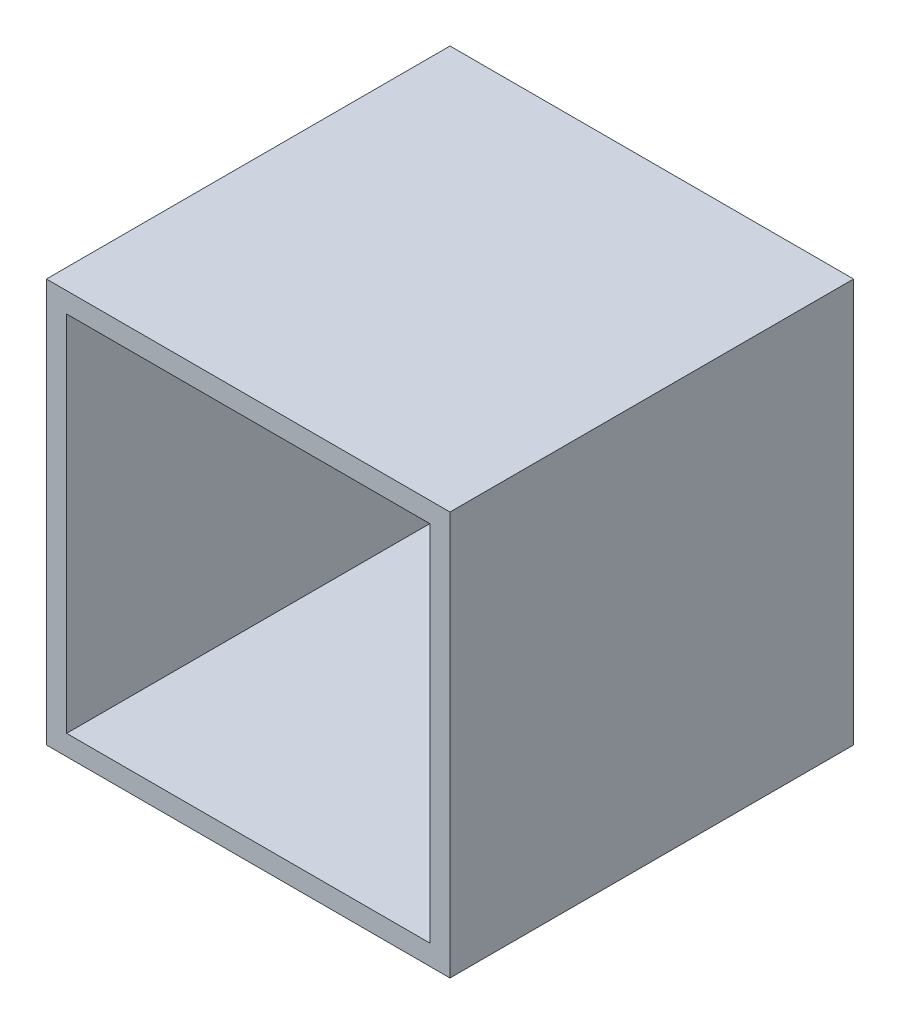
ISO-10303-21;
HEADER;
FILE_DESCRIPTION(('STEP AP214'),'2;1');
FILE_NAME('part.step','',(''),(''),'','','');
FILE_SCHEMA(('AUTOMOTIVE_DESIGN { 1 0 10303 214 1 1 1 1 }'));
ENDSEC;
DATA;
#1=APPLICATION_CONTEXT('core data for automotive mechanical design processes');
#2=APPLICATION_PROTOCOL_DEFINITION('international standard','automotive_design',2000,#1);
#3=PRODUCT_CONTEXT('',#1,'mechanical');
#4=PRODUCT('Part','Part','',(#3));
#5=PRODUCT_RELATED_PRODUCT_CATEGORY('part','',(#4));
#6=PRODUCT_DEFINITION_FORMATION('','',#4);
#7=PRODUCT_DEFINITION_CONTEXT('part definition',#1,'design');
#8=PRODUCT_DEFINITION('design','',#6,#7);
#9=PRODUCT_DEFINITION_SHAPE('','',#8);
#10=(LENGTH_UNIT() NAMED_UNIT(*) SI_UNIT(.MILLI.,.METRE.));
#11=(NAMED_UNIT(*) PLANE_ANGLE_UNIT() SI_UNIT($,.RADIAN.));
#12=(NAMED_UNIT(*) SI_UNIT($,.STERADIAN.) SOLID_ANGLE_UNIT());
#13=UNCERTAINTY_MEASURE_WITH_UNIT(LENGTH_MEASURE(1.E-05),#10,'distance_accuracy_value','');
#14=(GEOMETRIC_REPRESENTATION_CONTEXT(3) GLOBAL_UNCERTAINTY_ASSIGNED_CONTEXT((#13)) GLOBAL_UNIT_ASSIGNED_CONTEXT((#10,
#11,#12)) REPRESENTATION_CONTEXT('',''));
#15=CARTESIAN_POINT('',(0.,0.,0.));
#16=DIRECTION('',(0.,0.,1.));
#17=DIRECTION('',(1.,0.,0.));
#18=AXIS2_PLACEMENT_3D('',#15,#16,#17);
#19=CARTESIAN_POINT('',(-55.8985026380385,13.7040397267384,100.));
#20=DIRECTION('',(1.,0.,0.));
#21=DIRECTION('',(0.,1.,0.));
#22=AXIS2_PLACEMENT_3D('',#19,#20,#21);
#23=PLANE('',#22);
#24=DIRECTION('',(0.,-1.,0.));
#25=VECTOR('',#24,1.);
#26=CARTESIAN_POINT('',(-55.8985026380385,13.7040397267384,0.));
#27=LINE('',#26,#25);
#28=CARTESIAN_POINT('',(-55.8985026380385,13.7040397267384,0.));
#29=VERTEX_POINT('',#28);
#30=CARTESIAN_POINT('',(-55.8985026380385,-86.2959602732616,0.));
#31=VERTEX_POINT('',#30);
#32=EDGE_CURVE('E147',#29,#31,#27,.T.);
#33=ORIENTED_EDGE('',*,*,#32,.T.);
#34=DIRECTION('',(0.,0.,-1.));
#35=VECTOR('',#34,1.);
#36=CARTESIAN_POINT('',(-55.8985026380385,-86.2959602732616,100.));
#37=LINE('',#36,#35);
#38=CARTESIAN_POINT('',(-55.8985026380385,-86.2959602732616,100.));
#39=VERTEX_POINT('',#38);
#40=EDGE_CURVE('E11',#39,#31,#37,.T.);
#41=ORIENTED_EDGE('',*,*,#40,.F.);
#42=DIRECTION('',(0.,-1.,0.));
#43=VECTOR('',#42,1.);
#44=CARTESIAN_POINT('',(-55.8985026380385,13.7040397267384,100.));
#45=LINE('',#44,#43);
#46=CARTESIAN_POINT('',(-55.8985026380385,13.7040397267384,100.));
#47=VERTEX_POINT('',#46);
#48=EDGE_CURVE('E140',#47,#39,#45,.T.);
#49=ORIENTED_EDGE('',*,*,#48,.F.);
#50=DIRECTION('',(0.,0.,-1.));
#51=VECTOR('',#50,1.);
#52=CARTESIAN_POINT('',(-55.8985026380385,13.7040397267384,100.));
#53=LINE('',#52,#51);
#54=EDGE_CURVE('E146',#47,#29,#53,.T.);
#55=ORIENTED_EDGE('',*,*,#54,.T.);
#56=EDGE_LOOP('',(#33,#41,#49,#55));
#57=FACE_BOUND('',#56,.T.);
#58=ADVANCED_FACE('F33',(#57),#23,.F.);
#59=CARTESIAN_POINT('',(-55.8985026380385,-86.2959602732616,100.));
#60=DIRECTION('',(0.,1.,0.));
#61=DIRECTION('',(0.,0.,1.));
#62=AXIS2_PLACEMENT_3D('',#59,#60,#61);
#63=PLANE('',#62);
#64=DIRECTION('',(1.,0.,0.));
#65=VECTOR('',#64,1.);
#66=CARTESIAN_POINT('',(-55.8985026380385,-86.2959602732616,0.));
#67=LINE('',#66,#65);
#68=CARTESIAN_POINT('',(44.1014973619615,-86.2959602732616,0.));
#69=VERTEX_POINT('',#68);
#70=EDGE_CURVE('E150',#31,#69,#67,.T.);
#71=ORIENTED_EDGE('',*,*,#70,.T.);
#72=DIRECTION('',(0.,0.,-1.));
#73=VECTOR('',#72,1.);
#74=CARTESIAN_POINT('',(44.1014973619615,-86.2959602732616,100.));
#75=LINE('',#74,#73);
#76=CARTESIAN_POINT('',(44.1014973619615,-86.2959602732616,100.));
#77=VERTEX_POINT('',#76);
#78=EDGE_CURVE('E40',#77,#69,#75,.T.);
#79=ORIENTED_EDGE('',*,*,#78,.F.);
#80=DIRECTION('',(1.,0.,0.));
#81=VECTOR('',#80,1.);
#82=CARTESIAN_POINT('',(-55.8985026380385,-86.2959602732616,100.));
#83=LINE('',#82,#81);
#84=EDGE_CURVE('E84',#39,#77,#83,.T.);
#85=ORIENTED_EDGE('',*,*,#84,.F.);
#86=ORIENTED_EDGE('',*,*,#40,.T.);
#87=EDGE_LOOP('',(#71,#79,#85,#86));
#88=FACE_BOUND('',#87,.T.);
#89=ADVANCED_FACE('F179',(#88),#63,.F.);
#90=CARTESIAN_POINT('',(44.1014973619615,13.7040397267384,100.));
#91=DIRECTION('',(-1.,0.,0.));
#92=DIRECTION('',(0.,-1.,0.));
#93=AXIS2_PLACEMENT_3D('',#90,#91,#92);
#94=PLANE('',#93);
#95=DIRECTION('',(0.,1.,0.));
#96=VECTOR('',#95,1.);
#97=CARTESIAN_POINT('',(44.1014973619615,13.7040397267384,0.));
#98=LINE('',#97,#96);
#99=CARTESIAN_POINT('',(44.1014973619615,13.7040397267384,0.));
#100=VERTEX_POINT('',#99);
#101=EDGE_CURVE('E152',#69,#100,#98,.T.);
#102=ORIENTED_EDGE('',*,*,#101,.T.);
#103=DIRECTION('',(0.,0.,-1.));
#104=VECTOR('',#103,1.);
#105=CARTESIAN_POINT('',(44.1014973619615,13.7040397267384,100.));
#106=LINE('',#105,#104);
#107=CARTESIAN_POINT('',(44.1014973619615,13.7040397267384,100.));
#108=VERTEX_POINT('',#107);
#109=EDGE_CURVE('E156',#108,#100,#106,.T.);
#110=ORIENTED_EDGE('',*,*,#109,.F.);
#111=DIRECTION('',(0.,1.,0.));
#112=VECTOR('',#111,1.);
#113=CARTESIAN_POINT('',(44.1014973619615,13.7040397267384,100.));
#114=LINE('',#113,#112);
#115=EDGE_CURVE('E143',#77,#108,#114,.T.);
#116=ORIENTED_EDGE('',*,*,#115,.F.);
#117=ORIENTED_EDGE('',*,*,#78,.T.);
#118=EDGE_LOOP('',(#102,#110,#116,#117));
#119=FACE_BOUND('',#118,.T.);
#120=ADVANCED_FACE('F161',(#119),#94,.F.);
#121=CARTESIAN_POINT('',(-55.8985026380385,13.7040397267384,100.));
#122=DIRECTION('',(0.,-1.,0.));
#123=DIRECTION('',(0.,0.,-1.));
#124=AXIS2_PLACEMENT_3D('',#121,#122,#123);
#125=PLANE('',#124);
#126=DIRECTION('',(-1.,0.,0.));
#127=VECTOR('',#126,1.);
#128=CARTESIAN_POINT('',(-55.8985026380385,13.7040397267384,0.));
#129=LINE('',#128,#127);
#130=EDGE_CURVE('E77',#100,#29,#129,.T.);
#131=ORIENTED_EDGE('',*,*,#130,.T.);
#132=ORIENTED_EDGE('',*,*,#54,.F.);
#133=DIRECTION('',(-1.,0.,0.));
#134=VECTOR('',#133,1.);
#135=CARTESIAN_POINT('',(-55.8985026380385,13.7040397267384,100.));
#136=LINE('',#135,#134);
#137=EDGE_CURVE('E56',#108,#47,#136,.T.);
#138=ORIENTED_EDGE('',*,*,#137,.F.);
#139=ORIENTED_EDGE('',*,*,#109,.T.);
#140=EDGE_LOOP('',(#131,#132,#138,#139));
#141=FACE_BOUND('',#140,.T.);
#142=ADVANCED_FACE('F169',(#141),#125,.F.);
#143=CARTESIAN_POINT('',(0.,0.,100.));
#144=DIRECTION('',(0.,0.,1.));
#145=DIRECTION('',(1.,0.,0.));
#146=AXIS2_PLACEMENT_3D('',#143,#144,#145);
#147=PLANE('',#146);
#148=DIRECTION('',(0.,-1.,0.));
#149=VECTOR('',#148,1.);
#150=CARTESIAN_POINT('',(-50.8985026380385,13.7040397267384,100.));
#151=LINE('',#150,#149);
#152=CARTESIAN_POINT('',(-50.8985026380385,8.70403972673842,100.));
#153=VERTEX_POINT('',#152);
#154=CARTESIAN_POINT('',(-50.8985026380385,-81.2959602732616,100.));
#155=VERTEX_POINT('',#154);
#156=EDGE_CURVE('E129',#153,#155,#151,.T.);
#157=ORIENTED_EDGE('',*,*,#156,.F.);
#158=DIRECTION('',(-1.,0.,0.));
#159=VECTOR('',#158,1.);
#160=CARTESIAN_POINT('',(-55.8985026380385,8.70403972673842,100.));
#161=LINE('',#160,#159);
#162=CARTESIAN_POINT('',(39.1014973619615,8.70403972673842,100.));
#163=VERTEX_POINT('',#162);
#164=EDGE_CURVE('E138',#163,#153,#161,.T.);
#165=ORIENTED_EDGE('',*,*,#164,.F.);
#166=DIRECTION('',(0.,1.,0.));
#167=VECTOR('',#166,1.);
#168=CARTESIAN_POINT('',(39.1014973619615,13.7040397267384,100.));
#169=LINE('',#168,#167);
#170=CARTESIAN_POINT('',(39.1014973619615,-81.2959602732616,100.));
#171=VERTEX_POINT('',#170);
#172=EDGE_CURVE('E136',#171,#163,#169,.T.);
#173=ORIENTED_EDGE('',*,*,#172,.F.);
#174=DIRECTION('',(1.,0.,0.));
#175=VECTOR('',#174,1.);
#176=CARTESIAN_POINT('',(-55.8985026380385,-81.2959602732616,100.));
#177=LINE('',#176,#175);
#178=EDGE_CURVE('E121',#155,#171,#177,.T.);
#179=ORIENTED_EDGE('',*,*,#178,.F.);
#180=EDGE_LOOP('',(#157,#165,#173,#179));
#181=FACE_BOUND('',#180,.T.);
#182=ORIENTED_EDGE('',*,*,#48,.T.);
#183=ORIENTED_EDGE('',*,*,#84,.T.);
#184=ORIENTED_EDGE('',*,*,#115,.T.);
#185=ORIENTED_EDGE('',*,*,#137,.T.);
#186=EDGE_LOOP('',(#182,#183,#184,#185));
#187=FACE_BOUND('',#186,.T.);
#188=ADVANCED_FACE('F171',(#181,#187),#147,.T.);
#189=CARTESIAN_POINT('',(0.,0.,0.));
#190=DIRECTION('',(0.,0.,1.));
#191=DIRECTION('',(1.,0.,0.));
#192=AXIS2_PLACEMENT_3D('',#189,#190,#191);
#193=PLANE('',#192);
#194=ORIENTED_EDGE('',*,*,#32,.F.);
#195=ORIENTED_EDGE('',*,*,#130,.F.);
#196=ORIENTED_EDGE('',*,*,#101,.F.);
#197=ORIENTED_EDGE('',*,*,#70,.F.);
#198=EDGE_LOOP('',(#194,#195,#196,#197));
#199=FACE_BOUND('',#198,.T.);
#200=ADVANCED_FACE('F165',(#199),#193,.F.);
#201=CARTESIAN_POINT('',(-50.8985026380385,13.7040397267384,100.));
#202=DIRECTION('',(1.,0.,0.));
#203=DIRECTION('',(0.,1.,0.));
#204=AXIS2_PLACEMENT_3D('',#201,#202,#203);
#205=PLANE('',#204);
#206=DIRECTION('',(0.,-1.,0.));
#207=VECTOR('',#206,1.);
#208=CARTESIAN_POINT('',(-50.8985026380385,13.7040397267384,5.));
#209=LINE('',#208,#207);
#210=CARTESIAN_POINT('',(-50.8985026380385,8.70403972673842,5.));
#211=VERTEX_POINT('',#210);
#212=CARTESIAN_POINT('',(-50.8985026380385,-81.2959602732616,5.));
#213=VERTEX_POINT('',#212);
#214=EDGE_CURVE('E112',#211,#213,#209,.T.);
#215=ORIENTED_EDGE('',*,*,#214,.F.);
#216=DIRECTION('',(0.,0.,-1.));
#217=VECTOR('',#216,1.);
#218=CARTESIAN_POINT('',(-50.8985026380385,8.70403972673842,100.));
#219=LINE('',#218,#217);
#220=EDGE_CURVE('E132',#153,#211,#219,.T.);
#221=ORIENTED_EDGE('',*,*,#220,.F.);
#222=ORIENTED_EDGE('',*,*,#156,.T.);
#223=DIRECTION('',(0.,0.,-1.));
#224=VECTOR('',#223,1.);
#225=CARTESIAN_POINT('',(-50.8985026380385,-81.2959602732616,100.));
#226=LINE('',#225,#224);
#227=EDGE_CURVE('E124',#155,#213,#226,.T.);
#228=ORIENTED_EDGE('',*,*,#227,.T.);
#229=EDGE_LOOP('',(#215,#221,#222,#228));
#230=FACE_BOUND('',#229,.T.);
#231=ADVANCED_FACE('F205',(#230),#205,.T.);
#232=CARTESIAN_POINT('',(-55.8985026380385,-81.2959602732616,100.));
#233=DIRECTION('',(0.,1.,0.));
#234=DIRECTION('',(0.,0.,1.));
#235=AXIS2_PLACEMENT_3D('',#232,#233,#234);
#236=PLANE('',#235);
#237=DIRECTION('',(1.,0.,0.));
#238=VECTOR('',#237,1.);
#239=CARTESIAN_POINT('',(-55.8985026380385,-81.2959602732616,5.));
#240=LINE('',#239,#238);
#241=CARTESIAN_POINT('',(39.1014973619615,-81.2959602732616,5.));
#242=VERTEX_POINT('',#241);
#243=EDGE_CURVE('E106',#213,#242,#240,.T.);
#244=ORIENTED_EDGE('',*,*,#243,.F.);
#245=ORIENTED_EDGE('',*,*,#227,.F.);
#246=ORIENTED_EDGE('',*,*,#178,.T.);
#247=DIRECTION('',(0.,0.,-1.));
#248=VECTOR('',#247,1.);
#249=CARTESIAN_POINT('',(39.1014973619615,-81.2959602732616,100.));
#250=LINE('',#249,#248);
#251=EDGE_CURVE('E118',#171,#242,#250,.T.);
#252=ORIENTED_EDGE('',*,*,#251,.T.);
#253=EDGE_LOOP('',(#244,#245,#246,#252));
#254=FACE_BOUND('',#253,.T.);
#255=ADVANCED_FACE('F119',(#254),#236,.T.);
#256=CARTESIAN_POINT('',(39.1014973619615,13.7040397267384,100.));
#257=DIRECTION('',(-1.,0.,0.));
#258=DIRECTION('',(0.,-1.,0.));
#259=AXIS2_PLACEMENT_3D('',#256,#257,#258);
#260=PLANE('',#259);
#261=DIRECTION('',(0.,1.,0.));
#262=VECTOR('',#261,1.);
#263=CARTESIAN_POINT('',(39.1014973619615,13.7040397267384,5.));
#264=LINE('',#263,#262);
#265=CARTESIAN_POINT('',(39.1014973619615,8.70403972673842,5.));
#266=VERTEX_POINT('',#265);
#267=EDGE_CURVE('E110',#242,#266,#264,.T.);
#268=ORIENTED_EDGE('',*,*,#267,.F.);
#269=ORIENTED_EDGE('',*,*,#251,.F.);
#270=ORIENTED_EDGE('',*,*,#172,.T.);
#271=DIRECTION('',(0.,0.,-1.));
#272=VECTOR('',#271,1.);
#273=CARTESIAN_POINT('',(39.1014973619615,8.70403972673842,100.));
#274=LINE('',#273,#272);
#275=EDGE_CURVE('E47',#163,#266,#274,.T.);
#276=ORIENTED_EDGE('',*,*,#275,.T.);
#277=EDGE_LOOP('',(#268,#269,#270,#276));
#278=FACE_BOUND('',#277,.T.);
#279=ADVANCED_FACE('F126',(#278),#260,.T.);
#280=CARTESIAN_POINT('',(-55.8985026380385,8.70403972673842,100.));
#281=DIRECTION('',(0.,-1.,0.));
#282=DIRECTION('',(0.,0.,-1.));
#283=AXIS2_PLACEMENT_3D('',#280,#281,#282);
#284=PLANE('',#283);
#285=DIRECTION('',(-1.,0.,0.));
#286=VECTOR('',#285,1.);
#287=CARTESIAN_POINT('',(-55.8985026380385,8.70403972673842,5.));
#288=LINE('',#287,#286);
#289=EDGE_CURVE('E127',#266,#211,#288,.T.);
#290=ORIENTED_EDGE('',*,*,#289,.F.);
#291=ORIENTED_EDGE('',*,*,#275,.F.);
#292=ORIENTED_EDGE('',*,*,#164,.T.);
#293=ORIENTED_EDGE('',*,*,#220,.T.);
#294=EDGE_LOOP('',(#290,#291,#292,#293));
#295=FACE_BOUND('',#294,.T.);
#296=ADVANCED_FACE('F224',(#295),#284,.T.);
#297=CARTESIAN_POINT('',(0.,0.,5.));
#298=DIRECTION('',(0.,0.,1.));
#299=DIRECTION('',(1.,0.,0.));
#300=AXIS2_PLACEMENT_3D('',#297,#298,#299);
#301=PLANE('',#300);
#302=ORIENTED_EDGE('',*,*,#214,.T.);
#303=ORIENTED_EDGE('',*,*,#243,.T.);
#304=ORIENTED_EDGE('',*,*,#267,.T.);
#305=ORIENTED_EDGE('',*,*,#289,.T.);
#306=EDGE_LOOP('',(#302,#303,#304,#305));
#307=FACE_BOUND('',#306,.T.);
#308=ADVANCED_FACE('F108',(#307),#301,.T.);
#309=CLOSED_SHELL('',(#58,#89,#120,#142,#188,#200,#231,#255,#279,#296,#308));
#310=MANIFOLD_SOLID_BREP('B2',#309);
#311=ADVANCED_BREP_SHAPE_REPRESENTATION('',(#18,#310),#14);
#312=SHAPE_DEFINITION_REPRESENTATION(#9,#311);
ENDSEC;
END-ISO-10303-21;
